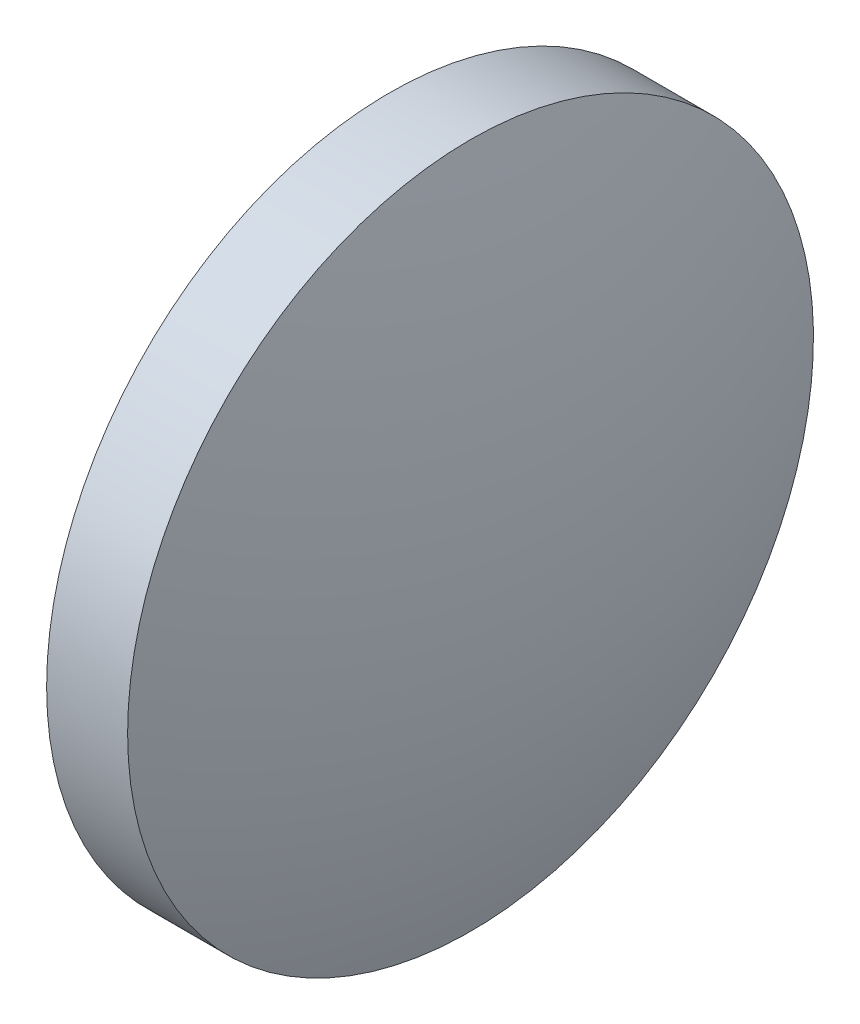
ISO-10303-21;
HEADER;
FILE_DESCRIPTION(('STEP AP214'),'2;1');
FILE_NAME('part.step','',(''),(''),'','','');
FILE_SCHEMA(('AUTOMOTIVE_DESIGN { 1 0 10303 214 1 1 1 1 }'));
ENDSEC;
DATA;
#1=APPLICATION_CONTEXT('core data for automotive mechanical design processes');
#2=APPLICATION_PROTOCOL_DEFINITION('international standard','automotive_design',2000,#1);
#3=PRODUCT_CONTEXT('',#1,'mechanical');
#4=PRODUCT('Part','Part','',(#3));
#5=PRODUCT_RELATED_PRODUCT_CATEGORY('part','',(#4));
#6=PRODUCT_DEFINITION_FORMATION('','',#4);
#7=PRODUCT_DEFINITION_CONTEXT('part definition',#1,'design');
#8=PRODUCT_DEFINITION('design','',#6,#7);
#9=PRODUCT_DEFINITION_SHAPE('','',#8);
#10=(LENGTH_UNIT() NAMED_UNIT(*) SI_UNIT(.MILLI.,.METRE.));
#11=(NAMED_UNIT(*) PLANE_ANGLE_UNIT() SI_UNIT($,.RADIAN.));
#12=(NAMED_UNIT(*) SI_UNIT($,.STERADIAN.) SOLID_ANGLE_UNIT());
#13=UNCERTAINTY_MEASURE_WITH_UNIT(LENGTH_MEASURE(1.E-05),#10,'distance_accuracy_value','');
#14=(GEOMETRIC_REPRESENTATION_CONTEXT(3) GLOBAL_UNCERTAINTY_ASSIGNED_CONTEXT((#13)) GLOBAL_UNIT_ASSIGNED_CONTEXT((#10,
#11,#12)) REPRESENTATION_CONTEXT('',''));
#15=CARTESIAN_POINT('',(0.,0.,0.));
#16=DIRECTION('',(0.,0.,1.));
#17=DIRECTION('',(1.,0.,0.));
#18=AXIS2_PLACEMENT_3D('',#15,#16,#17);
#19=CARTESIAN_POINT('',(588.477399392726,118.737386697994,0.));
#20=DIRECTION('',(-1.,0.,0.));
#21=DIRECTION('',(0.,1.,0.));
#22=AXIS2_PLACEMENT_3D('',#19,#20,#21);
#23=SPHERICAL_SURFACE('',#22,20.6612500000001);
#24=CARTESIAN_POINT('',(608.138649392726,118.737386697994,0.));
#25=DIRECTION('',(-1.,0.,0.));
#26=DIRECTION('',(0.,0.,1.));
#27=AXIS2_PLACEMENT_3D('',#24,#25,#26);
#28=CIRCLE('',#27,6.34999999999998);
#29=CARTESIAN_POINT('',(608.138649392726,118.737386697994,6.34999999999998));
#30=VERTEX_POINT('',#29);
#31=EDGE_CURVE('E10',#30,#30,#28,.T.);
#32=ORIENTED_EDGE('',*,*,#31,.F.);
#33=EDGE_LOOP('',(#32));
#34=FACE_BOUND('',#33,.T.);
#35=ADVANCED_FACE('F35',(#34),#23,.T.);
#36=CARTESIAN_POINT('',(604.378118246872,118.737386697994,0.));
#37=DIRECTION('',(-1.,0.,0.));
#38=DIRECTION('',(0.,0.,1.));
#39=AXIS2_PLACEMENT_3D('',#36,#37,#38);
#40=CYLINDRICAL_SURFACE('',#39,6.34999999999998);
#41=CARTESIAN_POINT('',(606.638649392726,118.737386697994,0.));
#42=DIRECTION('',(-1.,0.,0.));
#43=DIRECTION('',(0.,0.,1.));
#44=AXIS2_PLACEMENT_3D('',#41,#42,#43);
#45=CIRCLE('',#44,6.34999999999998);
#46=CARTESIAN_POINT('',(606.638649392726,118.737386697994,6.34999999999998));
#47=VERTEX_POINT('',#46);
#48=EDGE_CURVE('E41',#47,#47,#45,.T.);
#49=ORIENTED_EDGE('',*,*,#48,.F.);
#50=EDGE_LOOP('',(#49));
#51=FACE_BOUND('',#50,.T.);
#52=ORIENTED_EDGE('',*,*,#31,.T.);
#53=EDGE_LOOP('',(#52));
#54=FACE_BOUND('',#53,.T.);
#55=ADVANCED_FACE('F49',(#51,#54),#40,.T.);
#56=CARTESIAN_POINT('',(606.638649392726,118.737386697994,0.));
#57=DIRECTION('',(1.,0.,0.));
#58=DIRECTION('',(0.,0.,-1.));
#59=AXIS2_PLACEMENT_3D('',#56,#57,#58);
#60=PLANE('',#59);
#61=ORIENTED_EDGE('',*,*,#48,.T.);
#62=EDGE_LOOP('',(#61));
#63=FACE_BOUND('',#62,.T.);
#64=ADVANCED_FACE('F47',(#63),#60,.F.);
#65=CLOSED_SHELL('',(#35,#55,#64));
#66=MANIFOLD_SOLID_BREP('B2',#65);
#67=ADVANCED_BREP_SHAPE_REPRESENTATION('',(#18,#66),#14);
#68=SHAPE_DEFINITION_REPRESENTATION(#9,#67);
ENDSEC;
END-ISO-10303-21;
